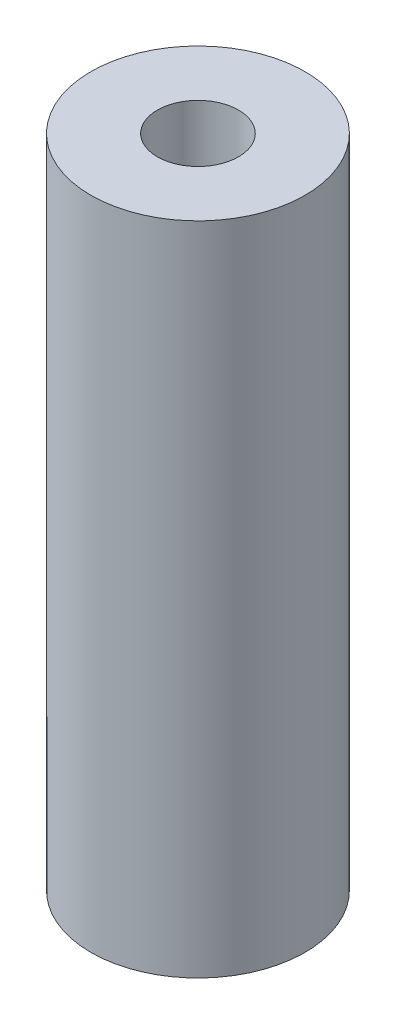
ISO-10303-21;
HEADER;
FILE_DESCRIPTION(('STEP AP214'),'2;1');
FILE_NAME('part.step','',(''),(''),'','','');
FILE_SCHEMA(('AUTOMOTIVE_DESIGN { 1 0 10303 214 1 1 1 1 }'));
ENDSEC;
DATA;
#1=APPLICATION_CONTEXT('core data for automotive mechanical design processes');
#2=APPLICATION_PROTOCOL_DEFINITION('international standard','automotive_design',2000,#1);
#3=PRODUCT_CONTEXT('',#1,'mechanical');
#4=PRODUCT('Part','Part','',(#3));
#5=PRODUCT_RELATED_PRODUCT_CATEGORY('part','',(#4));
#6=PRODUCT_DEFINITION_FORMATION('','',#4);
#7=PRODUCT_DEFINITION_CONTEXT('part definition',#1,'design');
#8=PRODUCT_DEFINITION('design','',#6,#7);
#9=PRODUCT_DEFINITION_SHAPE('','',#8);
#10=(LENGTH_UNIT() NAMED_UNIT(*) SI_UNIT(.MILLI.,.METRE.));
#11=(NAMED_UNIT(*) PLANE_ANGLE_UNIT() SI_UNIT($,.RADIAN.));
#12=(NAMED_UNIT(*) SI_UNIT($,.STERADIAN.) SOLID_ANGLE_UNIT());
#13=UNCERTAINTY_MEASURE_WITH_UNIT(LENGTH_MEASURE(1.E-05),#10,'distance_accuracy_value','');
#14=(GEOMETRIC_REPRESENTATION_CONTEXT(3) GLOBAL_UNCERTAINTY_ASSIGNED_CONTEXT((#13)) GLOBAL_UNIT_ASSIGNED_CONTEXT((#10,
#11,#12)) REPRESENTATION_CONTEXT('',''));
#15=CARTESIAN_POINT('',(0.,0.,0.));
#16=DIRECTION('',(0.,0.,1.));
#17=DIRECTION('',(1.,0.,0.));
#18=AXIS2_PLACEMENT_3D('',#15,#16,#17);
#19=CARTESIAN_POINT('',(0.,19.05,0.));
#20=DIRECTION('',(0.,1.,0.));
#21=DIRECTION('',(0.,0.,1.));
#22=AXIS2_PLACEMENT_3D('',#19,#20,#21);
#23=PLANE('',#22);
#24=CARTESIAN_POINT('',(0.,19.05,0.));
#25=DIRECTION('',(0.,1.,0.));
#26=DIRECTION('',(0.,0.,1.));
#27=AXIS2_PLACEMENT_3D('',#24,#25,#26);
#28=CIRCLE('',#27,3.1115);
#29=CARTESIAN_POINT('',(0.,19.05,3.1115));
#30=VERTEX_POINT('',#29);
#31=EDGE_CURVE('E10',#30,#30,#28,.T.);
#32=ORIENTED_EDGE('',*,*,#31,.T.);
#33=EDGE_LOOP('',(#32));
#34=FACE_BOUND('',#33,.T.);
#35=CARTESIAN_POINT('',(0.,19.05,0.));
#36=DIRECTION('',(0.,1.,0.));
#37=DIRECTION('',(0.,0.,1.));
#38=AXIS2_PLACEMENT_3D('',#35,#36,#37);
#39=CIRCLE('',#38,1.1780753916662);
#40=CARTESIAN_POINT('',(0.,19.05,1.1780753916662));
#41=VERTEX_POINT('',#40);
#42=EDGE_CURVE('E43',#41,#41,#39,.T.);
#43=ORIENTED_EDGE('',*,*,#42,.F.);
#44=EDGE_LOOP('',(#43));
#45=FACE_BOUND('',#44,.T.);
#46=ADVANCED_FACE('F32',(#34,#45),#23,.T.);
#47=CARTESIAN_POINT('',(0.,0.,0.));
#48=DIRECTION('',(0.,1.,0.));
#49=DIRECTION('',(0.,0.,1.));
#50=AXIS2_PLACEMENT_3D('',#47,#48,#49);
#51=PLANE('',#50);
#52=CARTESIAN_POINT('',(0.,0.,0.));
#53=DIRECTION('',(0.,1.,0.));
#54=DIRECTION('',(0.,0.,1.));
#55=AXIS2_PLACEMENT_3D('',#52,#53,#54);
#56=CIRCLE('',#55,3.1115);
#57=CARTESIAN_POINT('',(0.,0.,3.1115));
#58=VERTEX_POINT('',#57);
#59=EDGE_CURVE('E36',#58,#58,#56,.T.);
#60=ORIENTED_EDGE('',*,*,#59,.F.);
#61=EDGE_LOOP('',(#60));
#62=FACE_BOUND('',#61,.T.);
#63=CARTESIAN_POINT('',(0.,0.,0.));
#64=DIRECTION('',(0.,1.,0.));
#65=DIRECTION('',(0.,0.,1.));
#66=AXIS2_PLACEMENT_3D('',#63,#64,#65);
#67=CIRCLE('',#66,1.1780753916662);
#68=CARTESIAN_POINT('',(0.,0.,1.1780753916662));
#69=VERTEX_POINT('',#68);
#70=EDGE_CURVE('E45',#69,#69,#67,.T.);
#71=ORIENTED_EDGE('',*,*,#70,.T.);
#72=EDGE_LOOP('',(#71));
#73=FACE_BOUND('',#72,.T.);
#74=ADVANCED_FACE('F56',(#62,#73),#51,.F.);
#75=CARTESIAN_POINT('',(0.,19.05,0.));
#76=DIRECTION('',(0.,-1.,0.));
#77=DIRECTION('',(0.,0.,-1.));
#78=AXIS2_PLACEMENT_3D('',#75,#76,#77);
#79=CYLINDRICAL_SURFACE('',#78,3.1115);
#80=ORIENTED_EDGE('',*,*,#31,.F.);
#81=EDGE_LOOP('',(#80));
#82=FACE_BOUND('',#81,.T.);
#83=ORIENTED_EDGE('',*,*,#59,.T.);
#84=EDGE_LOOP('',(#83));
#85=FACE_BOUND('',#84,.T.);
#86=ADVANCED_FACE('F34',(#82,#85),#79,.T.);
#87=CARTESIAN_POINT('',(0.,19.05,0.));
#88=DIRECTION('',(0.,-1.,0.));
#89=DIRECTION('',(0.,0.,-1.));
#90=AXIS2_PLACEMENT_3D('',#87,#88,#89);
#91=CYLINDRICAL_SURFACE('',#90,1.1780753916662);
#92=ORIENTED_EDGE('',*,*,#42,.T.);
#93=EDGE_LOOP('',(#92));
#94=FACE_BOUND('',#93,.T.);
#95=ORIENTED_EDGE('',*,*,#70,.F.);
#96=EDGE_LOOP('',(#95));
#97=FACE_BOUND('',#96,.T.);
#98=ADVANCED_FACE('F52',(#94,#97),#91,.F.);
#99=CLOSED_SHELL('',(#46,#74,#86,#98));
#100=MANIFOLD_SOLID_BREP('B2',#99);
#101=ADVANCED_BREP_SHAPE_REPRESENTATION('',(#18,#100),#14);
#102=SHAPE_DEFINITION_REPRESENTATION(#9,#101);
ENDSEC;
END-ISO-10303-21;
